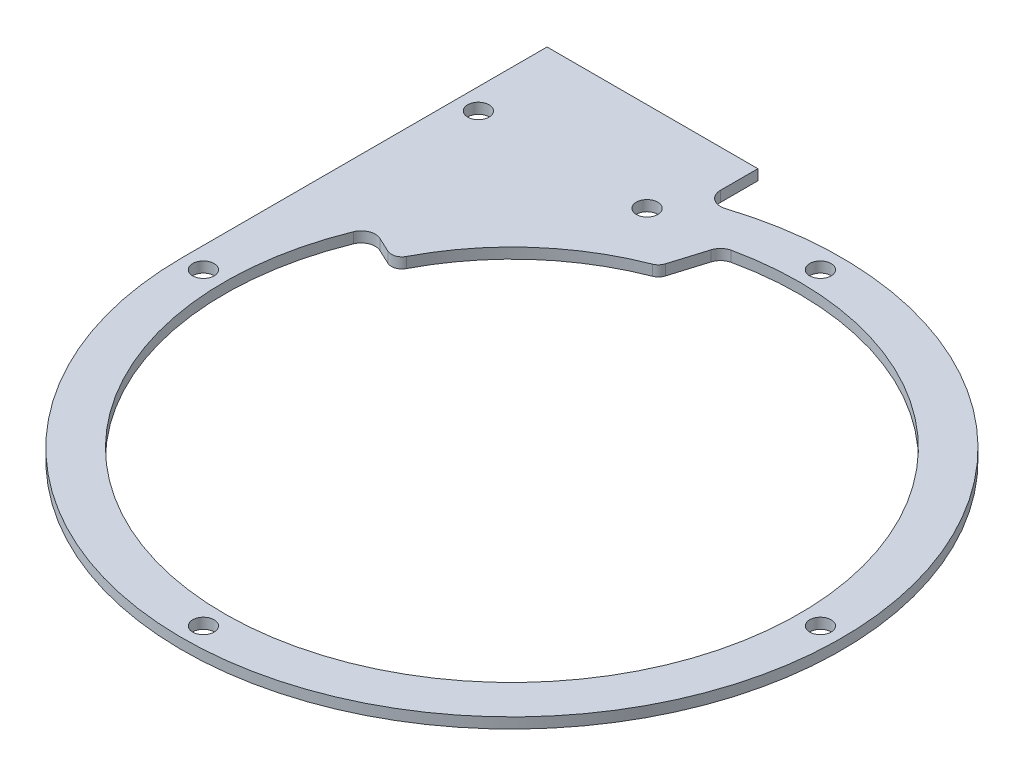
ISO-10303-21;
HEADER;
FILE_DESCRIPTION(('STEP AP214'),'2;1');
FILE_NAME('part.step','',(''),(''),'','','');
FILE_SCHEMA(('AUTOMOTIVE_DESIGN { 1 0 10303 214 1 1 1 1 }'));
ENDSEC;
DATA;
#1=APPLICATION_CONTEXT('core data for automotive mechanical design processes');
#2=APPLICATION_PROTOCOL_DEFINITION('international standard','automotive_design',2000,#1);
#3=PRODUCT_CONTEXT('',#1,'mechanical');
#4=PRODUCT('Part','Part','',(#3));
#5=PRODUCT_RELATED_PRODUCT_CATEGORY('part','',(#4));
#6=PRODUCT_DEFINITION_FORMATION('','',#4);
#7=PRODUCT_DEFINITION_CONTEXT('part definition',#1,'design');
#8=PRODUCT_DEFINITION('design','',#6,#7);
#9=PRODUCT_DEFINITION_SHAPE('','',#8);
#10=(LENGTH_UNIT() NAMED_UNIT(*) SI_UNIT(.MILLI.,.METRE.));
#11=(NAMED_UNIT(*) PLANE_ANGLE_UNIT() SI_UNIT($,.RADIAN.));
#12=(NAMED_UNIT(*) SI_UNIT($,.STERADIAN.) SOLID_ANGLE_UNIT());
#13=UNCERTAINTY_MEASURE_WITH_UNIT(LENGTH_MEASURE(1.E-05),#10,'distance_accuracy_value','');
#14=(GEOMETRIC_REPRESENTATION_CONTEXT(3) GLOBAL_UNCERTAINTY_ASSIGNED_CONTEXT((#13)) GLOBAL_UNIT_ASSIGNED_CONTEXT((#10,
#11,#12)) REPRESENTATION_CONTEXT('',''));
#15=CARTESIAN_POINT('',(0.,0.,0.));
#16=DIRECTION('',(0.,0.,1.));
#17=DIRECTION('',(1.,0.,0.));
#18=AXIS2_PLACEMENT_3D('',#15,#16,#17);
#19=CARTESIAN_POINT('',(0.,1.5,0.));
#20=DIRECTION('',(0.,-1.,0.));
#21=DIRECTION('',(0.,0.,-1.));
#22=AXIS2_PLACEMENT_3D('',#19,#20,#21);
#23=CYLINDRICAL_SURFACE('',#22,40.9);
#24=CARTESIAN_POINT('',(0.,1.5,0.));
#25=DIRECTION('',(0.,1.,0.));
#26=DIRECTION('',(0.,0.,1.));
#27=AXIS2_PLACEMENT_3D('',#24,#25,#26);
#28=CIRCLE('',#27,40.9);
#29=CARTESIAN_POINT('',(-37.9076569607055,1.5,-15.3564170218667));
#30=VERTEX_POINT('',#29);
#31=CARTESIAN_POINT('',(-8.74573285305339,1.5,-39.9540005113759));
#32=VERTEX_POINT('',#31);
#33=EDGE_CURVE('E233',#30,#32,#28,.T.);
#34=ORIENTED_EDGE('',*,*,#33,.T.);
#35=DIRECTION('',(0.,-1.,0.));
#36=VECTOR('',#35,1.);
#37=CARTESIAN_POINT('',(-8.74573285305339,1.5,-39.9540005113759));
#38=LINE('',#37,#36);
#39=CARTESIAN_POINT('',(-8.74573285305339,0.,-39.9540005113759));
#40=VERTEX_POINT('',#39);
#41=EDGE_CURVE('E261',#32,#40,#38,.T.);
#42=ORIENTED_EDGE('',*,*,#41,.T.);
#43=CARTESIAN_POINT('',(0.,0.,0.));
#44=DIRECTION('',(0.,1.,0.));
#45=DIRECTION('',(0.,0.,1.));
#46=AXIS2_PLACEMENT_3D('',#43,#44,#45);
#47=CIRCLE('',#46,40.9);
#48=CARTESIAN_POINT('',(-37.9076569607055,0.,-15.3564170218667));
#49=VERTEX_POINT('',#48);
#50=EDGE_CURVE('E230',#49,#40,#47,.T.);
#51=ORIENTED_EDGE('',*,*,#50,.F.);
#52=DIRECTION('',(0.,-1.,0.));
#53=VECTOR('',#52,1.);
#54=CARTESIAN_POINT('',(-37.9076569607055,1.5,-15.3564170218667));
#55=LINE('',#54,#53);
#56=EDGE_CURVE('E259',#49,#30,#55,.F.);
#57=ORIENTED_EDGE('',*,*,#56,.T.);
#58=EDGE_LOOP('',(#34,#42,#51,#57));
#59=FACE_BOUND('',#58,.T.);
#60=ADVANCED_FACE('F34',(#59),#23,.F.);
#61=CARTESIAN_POINT('',(0.,1.5,0.));
#62=DIRECTION('',(0.,1.,0.));
#63=DIRECTION('',(0.,0.,1.));
#64=AXIS2_PLACEMENT_3D('',#61,#62,#63);
#65=PLANE('',#64);
#66=CARTESIAN_POINT('',(-43.9,1.5,0.));
#67=DIRECTION('',(0.,1.,0.));
#68=DIRECTION('',(0.,0.,1.));
#69=AXIS2_PLACEMENT_3D('',#66,#67,#68);
#70=CIRCLE('',#69,1.525);
#71=CARTESIAN_POINT('',(-43.9,1.5,1.525));
#72=VERTEX_POINT('',#71);
#73=EDGE_CURVE('E203',#72,#72,#70,.T.);
#74=ORIENTED_EDGE('',*,*,#73,.F.);
#75=EDGE_LOOP('',(#74));
#76=FACE_BOUND('',#75,.T.);
#77=CARTESIAN_POINT('',(43.9,1.5,0.));
#78=DIRECTION('',(0.,1.,0.));
#79=DIRECTION('',(0.,0.,1.));
#80=AXIS2_PLACEMENT_3D('',#77,#78,#79);
#81=CIRCLE('',#80,1.525);
#82=CARTESIAN_POINT('',(43.9,1.5,1.52500000000001));
#83=VERTEX_POINT('',#82);
#84=EDGE_CURVE('E215',#83,#83,#81,.T.);
#85=ORIENTED_EDGE('',*,*,#84,.F.);
#86=EDGE_LOOP('',(#85));
#87=FACE_BOUND('',#86,.T.);
#88=CARTESIAN_POINT('',(-19.9,1.5,-39.1305507244659));
#89=DIRECTION('',(0.,1.,0.));
#90=DIRECTION('',(0.,0.,1.));
#91=AXIS2_PLACEMENT_3D('',#88,#89,#90);
#92=CIRCLE('',#91,1.525);
#93=CARTESIAN_POINT('',(-19.9,1.5,-37.6055507244659));
#94=VERTEX_POINT('',#93);
#95=EDGE_CURVE('E227',#94,#94,#92,.T.);
#96=ORIENTED_EDGE('',*,*,#95,.F.);
#97=EDGE_LOOP('',(#96));
#98=FACE_BOUND('',#97,.T.);
#99=CARTESIAN_POINT('',(0.,1.5,0.));
#100=DIRECTION('',(0.,1.,0.));
#101=DIRECTION('',(0.,0.,1.));
#102=AXIS2_PLACEMENT_3D('',#99,#100,#101);
#103=CIRCLE('',#102,46.9);
#104=CARTESIAN_POINT('',(-46.9,1.5,0.));
#105=VERTEX_POINT('',#104);
#106=CARTESIAN_POINT('',(-14.2905930470348,1.5,-44.6697766992856));
#107=VERTEX_POINT('',#106);
#108=EDGE_CURVE('E239',#105,#107,#103,.T.);
#109=ORIENTED_EDGE('',*,*,#108,.T.);
#110=CARTESIAN_POINT('',(-14.9,1.5,-46.5746712280398));
#111=DIRECTION('',(0.,-1.,0.));
#112=DIRECTION('',(0.,0.,1.));
#113=AXIS2_PLACEMENT_3D('',#110,#111,#112);
#114=CIRCLE('',#113,2.00000000000001);
#115=CARTESIAN_POINT('',(-16.9,1.5,-46.5746712280398));
#116=VERTEX_POINT('',#115);
#117=EDGE_CURVE('E242',#107,#116,#114,.T.);
#118=ORIENTED_EDGE('',*,*,#117,.T.);
#119=DIRECTION('',(0.,0.,-1.));
#120=VECTOR('',#119,1.);
#121=CARTESIAN_POINT('',(-16.9,1.5,-46.9));
#122=LINE('',#121,#120);
#123=CARTESIAN_POINT('',(-16.9,1.5,-51.9));
#124=VERTEX_POINT('',#123);
#125=EDGE_CURVE('E244',#116,#124,#122,.T.);
#126=ORIENTED_EDGE('',*,*,#125,.T.);
#127=DIRECTION('',(-1.,0.,0.));
#128=VECTOR('',#127,1.);
#129=CARTESIAN_POINT('',(-46.9,1.5,-51.9));
#130=LINE('',#129,#128);
#131=CARTESIAN_POINT('',(-46.9,1.5,-51.9));
#132=VERTEX_POINT('',#131);
#133=EDGE_CURVE('E148',#124,#132,#130,.T.);
#134=ORIENTED_EDGE('',*,*,#133,.T.);
#135=DIRECTION('',(0.,0.,1.));
#136=VECTOR('',#135,1.);
#137=CARTESIAN_POINT('',(-46.9,1.5,0.));
#138=LINE('',#137,#136);
#139=EDGE_CURVE('E246',#132,#105,#138,.T.);
#140=ORIENTED_EDGE('',*,*,#139,.T.);
#141=EDGE_LOOP('',(#109,#118,#126,#134,#140));
#142=FACE_BOUND('',#141,.T.);
#143=ORIENTED_EDGE('',*,*,#33,.F.);
#144=CARTESIAN_POINT('',(-36.0539818037028,1.5,-14.6054919841226));
#145=DIRECTION('',(0.,1.,0.));
#146=DIRECTION('',(0.,0.,1.));
#147=AXIS2_PLACEMENT_3D('',#144,#145,#146);
#148=CIRCLE('',#147,2.);
#149=CARTESIAN_POINT('',(-35.2087452802214,1.5,-16.4181075581959));
#150=VERTEX_POINT('',#149);
#151=EDGE_CURVE('E11',#30,#150,#148,.F.);
#152=ORIENTED_EDGE('',*,*,#151,.T.);
#153=DIRECTION('',(0.906307787036649,0.,0.422618261740701));
#154=VECTOR('',#153,1.);
#155=CARTESIAN_POINT('',(-37.067988489799,1.5,-17.2850869051946));
#156=LINE('',#155,#154);
#157=CARTESIAN_POINT('',(-33.0522882784468,1.5,-15.4125351437864));
#158=VERTEX_POINT('',#157);
#159=EDGE_CURVE('E182',#150,#158,#156,.T.);
#160=ORIENTED_EDGE('',*,*,#159,.T.);
#161=CARTESIAN_POINT('',(-32.4183608858357,1.5,-16.7719968243414));
#162=DIRECTION('',(0.,1.,0.));
#163=DIRECTION('',(0.,0.,1.));
#164=AXIS2_PLACEMENT_3D('',#161,#162,#163);
#165=CIRCLE('',#164,1.50000000000001);
#166=CARTESIAN_POINT('',(-31.0860994795685,1.5,-16.0827366808753));
#167=VERTEX_POINT('',#166);
#168=EDGE_CURVE('E178',#158,#167,#165,.T.);
#169=ORIENTED_EDGE('',*,*,#168,.T.);
#170=CARTESIAN_POINT('',(0.,1.5,0.));
#171=DIRECTION('',(0.,1.,0.));
#172=DIRECTION('',(0.,0.,1.));
#173=AXIS2_PLACEMENT_3D('',#170,#171,#172);
#174=CIRCLE('',#173,35.);
#175=CARTESIAN_POINT('',(-12.6475074807613,1.5,-32.6349590856812));
#176=VERTEX_POINT('',#175);
#177=EDGE_CURVE('E163',#167,#176,#174,.F.);
#178=ORIENTED_EDGE('',*,*,#177,.T.);
#179=CARTESIAN_POINT('',(-13.1895435156511,1.5,-34.0336001893533));
#180=DIRECTION('',(0.,1.,0.));
#181=DIRECTION('',(0.,0.,1.));
#182=AXIS2_PLACEMENT_3D('',#179,#180,#181);
#183=CIRCLE('',#182,1.5);
#184=CARTESIAN_POINT('',(-11.7549918977161,1.5,-33.5953517946271));
#185=VERTEX_POINT('',#184);
#186=EDGE_CURVE('E187',#176,#185,#183,.T.);
#187=ORIENTED_EDGE('',*,*,#186,.T.);
#188=DIRECTION('',(0.292165596484111,0.,-0.956367745290003));
#189=VECTOR('',#188,1.);
#190=CARTESIAN_POINT('',(-11.7549918977161,1.5,-33.5953517946271));
#191=LINE('',#190,#189);
#192=CARTESIAN_POINT('',(-10.2308041454401,1.5,-38.5845908480421));
#193=VERTEX_POINT('',#192);
#194=EDGE_CURVE('E184',#185,#193,#191,.T.);
#195=ORIENTED_EDGE('',*,*,#194,.T.);
#196=CARTESIAN_POINT('',(-8.31806865486007,1.5,-38.0002596550739));
#197=DIRECTION('',(0.,1.,0.));
#198=DIRECTION('',(0.,0.,1.));
#199=AXIS2_PLACEMENT_3D('',#196,#197,#198);
#200=CIRCLE('',#199,2.);
#201=EDGE_CURVE('E270',#193,#32,#200,.F.);
#202=ORIENTED_EDGE('',*,*,#201,.T.);
#203=EDGE_LOOP('',(#143,#152,#160,#169,#178,#187,#195,#202));
#204=FACE_BOUND('',#203,.T.);
#205=CARTESIAN_POINT('',(0.,1.5,-43.9));
#206=DIRECTION('',(0.,1.,0.));
#207=DIRECTION('',(0.,0.,1.));
#208=AXIS2_PLACEMENT_3D('',#205,#206,#207);
#209=CIRCLE('',#208,1.525);
#210=CARTESIAN_POINT('',(0.,1.5,-42.375));
#211=VERTEX_POINT('',#210);
#212=EDGE_CURVE('E221',#211,#211,#209,.T.);
#213=ORIENTED_EDGE('',*,*,#212,.F.);
#214=EDGE_LOOP('',(#213));
#215=FACE_BOUND('',#214,.T.);
#216=CARTESIAN_POINT('',(0.,1.5,43.9));
#217=DIRECTION('',(0.,1.,0.));
#218=DIRECTION('',(0.,0.,1.));
#219=AXIS2_PLACEMENT_3D('',#216,#217,#218);
#220=CIRCLE('',#219,1.525);
#221=CARTESIAN_POINT('',(0.,1.5,45.425));
#222=VERTEX_POINT('',#221);
#223=EDGE_CURVE('E209',#222,#222,#220,.T.);
#224=ORIENTED_EDGE('',*,*,#223,.F.);
#225=EDGE_LOOP('',(#224));
#226=FACE_BOUND('',#225,.T.);
#227=CARTESIAN_POINT('',(-43.9,1.5,-39.1305507244659));
#228=DIRECTION('',(0.,1.,0.));
#229=DIRECTION('',(0.,0.,1.));
#230=AXIS2_PLACEMENT_3D('',#227,#228,#229);
#231=CIRCLE('',#230,1.525);
#232=CARTESIAN_POINT('',(-43.9,1.5,-37.6055507244659));
#233=VERTEX_POINT('',#232);
#234=EDGE_CURVE('E197',#233,#233,#231,.T.);
#235=ORIENTED_EDGE('',*,*,#234,.F.);
#236=EDGE_LOOP('',(#235));
#237=FACE_BOUND('',#236,.T.);
#238=ADVANCED_FACE('F281',(#76,#87,#98,#142,#204,#215,#226,#237),#65,.T.);
#239=CARTESIAN_POINT('',(0.,0.,0.));
#240=DIRECTION('',(0.,1.,0.));
#241=DIRECTION('',(0.,0.,1.));
#242=AXIS2_PLACEMENT_3D('',#239,#240,#241);
#243=PLANE('',#242);
#244=CARTESIAN_POINT('',(0.,0.,0.));
#245=DIRECTION('',(0.,1.,0.));
#246=DIRECTION('',(0.,0.,1.));
#247=AXIS2_PLACEMENT_3D('',#244,#245,#246);
#248=CIRCLE('',#247,46.9);
#249=CARTESIAN_POINT('',(-46.9,0.,0.));
#250=VERTEX_POINT('',#249);
#251=CARTESIAN_POINT('',(-14.2905930470348,0.,-44.6697766992856));
#252=VERTEX_POINT('',#251);
#253=EDGE_CURVE('E236',#250,#252,#248,.T.);
#254=ORIENTED_EDGE('',*,*,#253,.F.);
#255=DIRECTION('',(0.,0.,1.));
#256=VECTOR('',#255,1.);
#257=CARTESIAN_POINT('',(-46.9,0.,0.));
#258=LINE('',#257,#256);
#259=CARTESIAN_POINT('',(-46.9,0.,-51.9));
#260=VERTEX_POINT('',#259);
#261=EDGE_CURVE('E139',#260,#250,#258,.T.);
#262=ORIENTED_EDGE('',*,*,#261,.F.);
#263=DIRECTION('',(-1.,0.,0.));
#264=VECTOR('',#263,1.);
#265=CARTESIAN_POINT('',(-46.9,0.,-51.9));
#266=LINE('',#265,#264);
#267=CARTESIAN_POINT('',(-16.9,0.,-51.9));
#268=VERTEX_POINT('',#267);
#269=EDGE_CURVE('E146',#268,#260,#266,.T.);
#270=ORIENTED_EDGE('',*,*,#269,.F.);
#271=DIRECTION('',(0.,0.,-1.));
#272=VECTOR('',#271,1.);
#273=CARTESIAN_POINT('',(-16.9,0.,-46.9));
#274=LINE('',#273,#272);
#275=CARTESIAN_POINT('',(-16.9,0.,-46.5746712280398));
#276=VERTEX_POINT('',#275);
#277=EDGE_CURVE('E129',#276,#268,#274,.T.);
#278=ORIENTED_EDGE('',*,*,#277,.F.);
#279=CARTESIAN_POINT('',(-14.9,0.,-46.5746712280398));
#280=DIRECTION('',(0.,-1.,0.));
#281=DIRECTION('',(0.,0.,1.));
#282=AXIS2_PLACEMENT_3D('',#279,#280,#281);
#283=CIRCLE('',#282,2.00000000000001);
#284=EDGE_CURVE('E140',#252,#276,#283,.T.);
#285=ORIENTED_EDGE('',*,*,#284,.F.);
#286=EDGE_LOOP('',(#254,#262,#270,#278,#285));
#287=FACE_BOUND('',#286,.T.);
#288=DIRECTION('',(0.906307787036649,0.,0.422618261740701));
#289=VECTOR('',#288,1.);
#290=CARTESIAN_POINT('',(-37.067988489799,0.,-17.2850869051946));
#291=LINE('',#290,#289);
#292=CARTESIAN_POINT('',(-35.2087452802214,0.,-16.4181075581959));
#293=VERTEX_POINT('',#292);
#294=CARTESIAN_POINT('',(-33.0522882784468,0.,-15.4125351437864));
#295=VERTEX_POINT('',#294);
#296=EDGE_CURVE('E169',#293,#295,#291,.T.);
#297=ORIENTED_EDGE('',*,*,#296,.F.);
#298=CARTESIAN_POINT('',(-36.0539818037028,0.,-14.6054919841226));
#299=DIRECTION('',(0.,1.,0.));
#300=DIRECTION('',(0.,0.,1.));
#301=AXIS2_PLACEMENT_3D('',#298,#299,#300);
#302=CIRCLE('',#301,2.);
#303=EDGE_CURVE('E42',#293,#49,#302,.T.);
#304=ORIENTED_EDGE('',*,*,#303,.T.);
#305=ORIENTED_EDGE('',*,*,#50,.T.);
#306=CARTESIAN_POINT('',(-8.31806865486007,0.,-38.0002596550739));
#307=DIRECTION('',(0.,1.,0.));
#308=DIRECTION('',(0.,0.,1.));
#309=AXIS2_PLACEMENT_3D('',#306,#307,#308);
#310=CIRCLE('',#309,2.);
#311=CARTESIAN_POINT('',(-10.2308041454401,0.,-38.5845908480421));
#312=VERTEX_POINT('',#311);
#313=EDGE_CURVE('E268',#40,#312,#310,.T.);
#314=ORIENTED_EDGE('',*,*,#313,.T.);
#315=DIRECTION('',(0.292165596484111,0.,-0.956367745290003));
#316=VECTOR('',#315,1.);
#317=CARTESIAN_POINT('',(-11.7549918977161,0.,-33.5953517946271));
#318=LINE('',#317,#316);
#319=CARTESIAN_POINT('',(-11.7549918977161,0.,-33.5953517946271));
#320=VERTEX_POINT('',#319);
#321=EDGE_CURVE('E171',#320,#312,#318,.T.);
#322=ORIENTED_EDGE('',*,*,#321,.F.);
#323=CARTESIAN_POINT('',(-13.1895435156511,0.,-34.0336001893533));
#324=DIRECTION('',(0.,1.,0.));
#325=DIRECTION('',(0.,0.,1.));
#326=AXIS2_PLACEMENT_3D('',#323,#324,#325);
#327=CIRCLE('',#326,1.5);
#328=CARTESIAN_POINT('',(-12.6475074807613,0.,-32.6349590856812));
#329=VERTEX_POINT('',#328);
#330=EDGE_CURVE('E175',#329,#320,#327,.T.);
#331=ORIENTED_EDGE('',*,*,#330,.F.);
#332=CARTESIAN_POINT('',(0.,0.,0.));
#333=DIRECTION('',(0.,-1.,0.));
#334=DIRECTION('',(0.,0.,1.));
#335=AXIS2_PLACEMENT_3D('',#332,#333,#334);
#336=CIRCLE('',#335,35.);
#337=CARTESIAN_POINT('',(-31.0860994795685,0.,-16.0827366808753));
#338=VERTEX_POINT('',#337);
#339=EDGE_CURVE('E160',#338,#329,#336,.T.);
#340=ORIENTED_EDGE('',*,*,#339,.F.);
#341=CARTESIAN_POINT('',(-32.4183608858357,0.,-16.7719968243414));
#342=DIRECTION('',(0.,1.,0.));
#343=DIRECTION('',(0.,0.,1.));
#344=AXIS2_PLACEMENT_3D('',#341,#342,#343);
#345=CIRCLE('',#344,1.50000000000001);
#346=EDGE_CURVE('E165',#295,#338,#345,.T.);
#347=ORIENTED_EDGE('',*,*,#346,.F.);
#348=EDGE_LOOP('',(#297,#304,#305,#314,#322,#331,#340,#347));
#349=FACE_BOUND('',#348,.T.);
#350=CARTESIAN_POINT('',(-19.9,0.,-39.1305507244659));
#351=DIRECTION('',(0.,1.,0.));
#352=DIRECTION('',(0.,0.,1.));
#353=AXIS2_PLACEMENT_3D('',#350,#351,#352);
#354=CIRCLE('',#353,1.525);
#355=CARTESIAN_POINT('',(-19.9,0.,-37.6055507244659));
#356=VERTEX_POINT('',#355);
#357=EDGE_CURVE('E224',#356,#356,#354,.T.);
#358=ORIENTED_EDGE('',*,*,#357,.T.);
#359=EDGE_LOOP('',(#358));
#360=FACE_BOUND('',#359,.T.);
#361=CARTESIAN_POINT('',(0.,0.,-43.9));
#362=DIRECTION('',(0.,1.,0.));
#363=DIRECTION('',(0.,0.,1.));
#364=AXIS2_PLACEMENT_3D('',#361,#362,#363);
#365=CIRCLE('',#364,1.525);
#366=CARTESIAN_POINT('',(0.,0.,-42.375));
#367=VERTEX_POINT('',#366);
#368=EDGE_CURVE('E218',#367,#367,#365,.T.);
#369=ORIENTED_EDGE('',*,*,#368,.T.);
#370=EDGE_LOOP('',(#369));
#371=FACE_BOUND('',#370,.T.);
#372=CARTESIAN_POINT('',(43.9,0.,0.));
#373=DIRECTION('',(0.,1.,0.));
#374=DIRECTION('',(0.,0.,1.));
#375=AXIS2_PLACEMENT_3D('',#372,#373,#374);
#376=CIRCLE('',#375,1.525);
#377=CARTESIAN_POINT('',(43.9,0.,1.52500000000001));
#378=VERTEX_POINT('',#377);
#379=EDGE_CURVE('E212',#378,#378,#376,.T.);
#380=ORIENTED_EDGE('',*,*,#379,.T.);
#381=EDGE_LOOP('',(#380));
#382=FACE_BOUND('',#381,.T.);
#383=CARTESIAN_POINT('',(0.,0.,43.9));
#384=DIRECTION('',(0.,1.,0.));
#385=DIRECTION('',(0.,0.,1.));
#386=AXIS2_PLACEMENT_3D('',#383,#384,#385);
#387=CIRCLE('',#386,1.525);
#388=CARTESIAN_POINT('',(0.,0.,45.425));
#389=VERTEX_POINT('',#388);
#390=EDGE_CURVE('E206',#389,#389,#387,.T.);
#391=ORIENTED_EDGE('',*,*,#390,.T.);
#392=EDGE_LOOP('',(#391));
#393=FACE_BOUND('',#392,.T.);
#394=CARTESIAN_POINT('',(-43.9,0.,0.));
#395=DIRECTION('',(0.,1.,0.));
#396=DIRECTION('',(0.,0.,1.));
#397=AXIS2_PLACEMENT_3D('',#394,#395,#396);
#398=CIRCLE('',#397,1.525);
#399=CARTESIAN_POINT('',(-43.9,0.,1.525));
#400=VERTEX_POINT('',#399);
#401=EDGE_CURVE('E200',#400,#400,#398,.T.);
#402=ORIENTED_EDGE('',*,*,#401,.T.);
#403=EDGE_LOOP('',(#402));
#404=FACE_BOUND('',#403,.T.);
#405=CARTESIAN_POINT('',(-43.9,0.,-39.1305507244659));
#406=DIRECTION('',(0.,1.,0.));
#407=DIRECTION('',(0.,0.,1.));
#408=AXIS2_PLACEMENT_3D('',#405,#406,#407);
#409=CIRCLE('',#408,1.525);
#410=CARTESIAN_POINT('',(-43.9,0.,-37.6055507244659));
#411=VERTEX_POINT('',#410);
#412=EDGE_CURVE('E181',#411,#411,#409,.T.);
#413=ORIENTED_EDGE('',*,*,#412,.T.);
#414=EDGE_LOOP('',(#413));
#415=FACE_BOUND('',#414,.T.);
#416=ADVANCED_FACE('F152',(#287,#349,#360,#371,#382,#393,#404,#415),#243,.F.);
#417=CARTESIAN_POINT('',(0.,1.5,0.));
#418=DIRECTION('',(0.,-1.,0.));
#419=DIRECTION('',(0.,0.,-1.));
#420=AXIS2_PLACEMENT_3D('',#417,#418,#419);
#421=CYLINDRICAL_SURFACE('',#420,46.9);
#422=ORIENTED_EDGE('',*,*,#253,.T.);
#423=DIRECTION('',(0.,-1.,0.));
#424=VECTOR('',#423,1.);
#425=CARTESIAN_POINT('',(-14.2905930470348,1.5,-44.6697766992856));
#426=LINE('',#425,#424);
#427=EDGE_CURVE('E256',#107,#252,#426,.T.);
#428=ORIENTED_EDGE('',*,*,#427,.F.);
#429=ORIENTED_EDGE('',*,*,#108,.F.);
#430=DIRECTION('',(0.,-1.,0.));
#431=VECTOR('',#430,1.);
#432=CARTESIAN_POINT('',(-46.9,1.5,0.));
#433=LINE('',#432,#431);
#434=EDGE_CURVE('E248',#105,#250,#433,.T.);
#435=ORIENTED_EDGE('',*,*,#434,.T.);
#436=EDGE_LOOP('',(#422,#428,#429,#435));
#437=FACE_BOUND('',#436,.T.);
#438=ADVANCED_FACE('F321',(#437),#421,.T.);
#439=CARTESIAN_POINT('',(-14.9,1.5,-46.5746712280398));
#440=DIRECTION('',(0.,-1.,0.));
#441=DIRECTION('',(0.,0.,-1.));
#442=AXIS2_PLACEMENT_3D('',#439,#440,#441);
#443=CYLINDRICAL_SURFACE('',#442,2.00000000000001);
#444=ORIENTED_EDGE('',*,*,#284,.T.);
#445=DIRECTION('',(0.,-1.,0.));
#446=VECTOR('',#445,1.);
#447=CARTESIAN_POINT('',(-16.9,1.5,-46.5746712280398));
#448=LINE('',#447,#446);
#449=EDGE_CURVE('E136',#116,#276,#448,.T.);
#450=ORIENTED_EDGE('',*,*,#449,.F.);
#451=ORIENTED_EDGE('',*,*,#117,.F.);
#452=ORIENTED_EDGE('',*,*,#427,.T.);
#453=EDGE_LOOP('',(#444,#450,#451,#452));
#454=FACE_BOUND('',#453,.T.);
#455=ADVANCED_FACE('F328',(#454),#443,.F.);
#456=CARTESIAN_POINT('',(-16.9,1.5,-46.9));
#457=DIRECTION('',(-1.,0.,0.));
#458=DIRECTION('',(0.,0.,1.));
#459=AXIS2_PLACEMENT_3D('',#456,#457,#458);
#460=PLANE('',#459);
#461=ORIENTED_EDGE('',*,*,#277,.T.);
#462=DIRECTION('',(0.,1.,0.));
#463=VECTOR('',#462,1.);
#464=CARTESIAN_POINT('',(-16.9,0.,-51.9));
#465=LINE('',#464,#463);
#466=EDGE_CURVE('E133',#268,#124,#465,.T.);
#467=ORIENTED_EDGE('',*,*,#466,.T.);
#468=ORIENTED_EDGE('',*,*,#125,.F.);
#469=ORIENTED_EDGE('',*,*,#449,.T.);
#470=EDGE_LOOP('',(#461,#467,#468,#469));
#471=FACE_BOUND('',#470,.T.);
#472=ADVANCED_FACE('F131',(#471),#460,.F.);
#473=CARTESIAN_POINT('',(-46.9,1.5,0.));
#474=DIRECTION('',(1.,0.,0.));
#475=DIRECTION('',(0.,0.,-1.));
#476=AXIS2_PLACEMENT_3D('',#473,#474,#475);
#477=PLANE('',#476);
#478=ORIENTED_EDGE('',*,*,#261,.T.);
#479=ORIENTED_EDGE('',*,*,#434,.F.);
#480=ORIENTED_EDGE('',*,*,#139,.F.);
#481=DIRECTION('',(0.,1.,0.));
#482=VECTOR('',#481,1.);
#483=CARTESIAN_POINT('',(-46.9,0.,-51.9));
#484=LINE('',#483,#482);
#485=EDGE_CURVE('E149',#260,#132,#484,.T.);
#486=ORIENTED_EDGE('',*,*,#485,.F.);
#487=EDGE_LOOP('',(#478,#479,#480,#486));
#488=FACE_BOUND('',#487,.T.);
#489=ADVANCED_FACE('F322',(#488),#477,.F.);
#490=CARTESIAN_POINT('',(-19.9,1.5,-39.1305507244659));
#491=DIRECTION('',(0.,-1.,0.));
#492=DIRECTION('',(0.,0.,-1.));
#493=AXIS2_PLACEMENT_3D('',#490,#491,#492);
#494=CYLINDRICAL_SURFACE('',#493,1.525);
#495=ORIENTED_EDGE('',*,*,#95,.T.);
#496=EDGE_LOOP('',(#495));
#497=FACE_BOUND('',#496,.T.);
#498=ORIENTED_EDGE('',*,*,#357,.F.);
#499=EDGE_LOOP('',(#498));
#500=FACE_BOUND('',#499,.T.);
#501=ADVANCED_FACE('F316',(#497,#500),#494,.F.);
#502=CARTESIAN_POINT('',(0.,1.5,-43.9));
#503=DIRECTION('',(0.,-1.,0.));
#504=DIRECTION('',(0.,0.,-1.));
#505=AXIS2_PLACEMENT_3D('',#502,#503,#504);
#506=CYLINDRICAL_SURFACE('',#505,1.525);
#507=ORIENTED_EDGE('',*,*,#212,.T.);
#508=EDGE_LOOP('',(#507));
#509=FACE_BOUND('',#508,.T.);
#510=ORIENTED_EDGE('',*,*,#368,.F.);
#511=EDGE_LOOP('',(#510));
#512=FACE_BOUND('',#511,.T.);
#513=ADVANCED_FACE('F360',(#509,#512),#506,.F.);
#514=CARTESIAN_POINT('',(43.9,1.5,0.));
#515=DIRECTION('',(0.,-1.,0.));
#516=DIRECTION('',(0.,0.,-1.));
#517=AXIS2_PLACEMENT_3D('',#514,#515,#516);
#518=CYLINDRICAL_SURFACE('',#517,1.525);
#519=ORIENTED_EDGE('',*,*,#84,.T.);
#520=EDGE_LOOP('',(#519));
#521=FACE_BOUND('',#520,.T.);
#522=ORIENTED_EDGE('',*,*,#379,.F.);
#523=EDGE_LOOP('',(#522));
#524=FACE_BOUND('',#523,.T.);
#525=ADVANCED_FACE('F367',(#521,#524),#518,.F.);
#526=CARTESIAN_POINT('',(0.,1.5,43.9));
#527=DIRECTION('',(0.,-1.,0.));
#528=DIRECTION('',(0.,0.,-1.));
#529=AXIS2_PLACEMENT_3D('',#526,#527,#528);
#530=CYLINDRICAL_SURFACE('',#529,1.525);
#531=ORIENTED_EDGE('',*,*,#223,.T.);
#532=EDGE_LOOP('',(#531));
#533=FACE_BOUND('',#532,.T.);
#534=ORIENTED_EDGE('',*,*,#390,.F.);
#535=EDGE_LOOP('',(#534));
#536=FACE_BOUND('',#535,.T.);
#537=ADVANCED_FACE('F374',(#533,#536),#530,.F.);
#538=CARTESIAN_POINT('',(-43.9,1.5,0.));
#539=DIRECTION('',(0.,-1.,0.));
#540=DIRECTION('',(0.,0.,-1.));
#541=AXIS2_PLACEMENT_3D('',#538,#539,#540);
#542=CYLINDRICAL_SURFACE('',#541,1.525);
#543=ORIENTED_EDGE('',*,*,#73,.T.);
#544=EDGE_LOOP('',(#543));
#545=FACE_BOUND('',#544,.T.);
#546=ORIENTED_EDGE('',*,*,#401,.F.);
#547=EDGE_LOOP('',(#546));
#548=FACE_BOUND('',#547,.T.);
#549=ADVANCED_FACE('F382',(#545,#548),#542,.F.);
#550=CARTESIAN_POINT('',(-43.9,1.5,-39.1305507244659));
#551=DIRECTION('',(0.,-1.,0.));
#552=DIRECTION('',(0.,0.,-1.));
#553=AXIS2_PLACEMENT_3D('',#550,#551,#552);
#554=CYLINDRICAL_SURFACE('',#553,1.525);
#555=ORIENTED_EDGE('',*,*,#234,.T.);
#556=EDGE_LOOP('',(#555));
#557=FACE_BOUND('',#556,.T.);
#558=ORIENTED_EDGE('',*,*,#412,.F.);
#559=EDGE_LOOP('',(#558));
#560=FACE_BOUND('',#559,.T.);
#561=ADVANCED_FACE('F390',(#557,#560),#554,.F.);
#562=CARTESIAN_POINT('',(-13.1895435156511,38.0293322414599,-34.0336001893533));
#563=DIRECTION('',(0.,-1.,0.));
#564=DIRECTION('',(0.,0.,-1.));
#565=AXIS2_PLACEMENT_3D('',#562,#563,#564);
#566=CYLINDRICAL_SURFACE('',#565,1.5);
#567=ORIENTED_EDGE('',*,*,#186,.F.);
#568=DIRECTION('',(0.,-1.,0.));
#569=VECTOR('',#568,1.);
#570=CARTESIAN_POINT('',(-12.6475074807613,38.0293322414599,-32.6349590856812));
#571=LINE('',#570,#569);
#572=EDGE_CURVE('E158',#176,#329,#571,.T.);
#573=ORIENTED_EDGE('',*,*,#572,.T.);
#574=ORIENTED_EDGE('',*,*,#330,.T.);
#575=DIRECTION('',(0.,-1.,0.));
#576=VECTOR('',#575,1.);
#577=CARTESIAN_POINT('',(-11.7549918977161,38.0293322414599,-33.5953517946271));
#578=LINE('',#577,#576);
#579=EDGE_CURVE('E174',#185,#320,#578,.T.);
#580=ORIENTED_EDGE('',*,*,#579,.F.);
#581=EDGE_LOOP('',(#567,#573,#574,#580));
#582=FACE_BOUND('',#581,.T.);
#583=ADVANCED_FACE('F293',(#582),#566,.T.);
#584=CARTESIAN_POINT('',(-11.7549918977161,38.0293322414599,-33.5953517946271));
#585=DIRECTION('',(-0.956367745290003,0.,-0.292165596484111));
#586=DIRECTION('',(-0.292165596484111,0.,0.956367745290003));
#587=AXIS2_PLACEMENT_3D('',#584,#585,#586);
#588=PLANE('',#587);
#589=ORIENTED_EDGE('',*,*,#321,.T.);
#590=DIRECTION('',(0.,-1.,0.));
#591=VECTOR('',#590,1.);
#592=CARTESIAN_POINT('',(-10.2308041454401,38.0293322414599,-38.5845908480421));
#593=LINE('',#592,#591);
#594=EDGE_CURVE('E264',#312,#193,#593,.F.);
#595=ORIENTED_EDGE('',*,*,#594,.T.);
#596=ORIENTED_EDGE('',*,*,#194,.F.);
#597=ORIENTED_EDGE('',*,*,#579,.T.);
#598=EDGE_LOOP('',(#589,#595,#596,#597));
#599=FACE_BOUND('',#598,.T.);
#600=ADVANCED_FACE('F297',(#599),#588,.F.);
#601=CARTESIAN_POINT('',(-37.067988489799,38.0293322414599,-17.2850869051946));
#602=DIRECTION('',(0.422618261740701,0.,-0.906307787036649));
#603=DIRECTION('',(-0.906307787036649,0.,-0.422618261740701));
#604=AXIS2_PLACEMENT_3D('',#601,#602,#603);
#605=PLANE('',#604);
#606=ORIENTED_EDGE('',*,*,#159,.F.);
#607=DIRECTION('',(0.,-1.,0.));
#608=VECTOR('',#607,1.);
#609=CARTESIAN_POINT('',(-35.2087452802214,38.0293322414599,-16.4181075581959));
#610=LINE('',#609,#608);
#611=EDGE_CURVE('E266',#150,#293,#610,.T.);
#612=ORIENTED_EDGE('',*,*,#611,.T.);
#613=ORIENTED_EDGE('',*,*,#296,.T.);
#614=DIRECTION('',(0.,-1.,0.));
#615=VECTOR('',#614,1.);
#616=CARTESIAN_POINT('',(-33.0522882784468,38.0293322414599,-15.4125351437864));
#617=LINE('',#616,#615);
#618=EDGE_CURVE('E168',#158,#295,#617,.T.);
#619=ORIENTED_EDGE('',*,*,#618,.F.);
#620=EDGE_LOOP('',(#606,#612,#613,#619));
#621=FACE_BOUND('',#620,.T.);
#622=ADVANCED_FACE('F278',(#621),#605,.F.);
#623=CARTESIAN_POINT('',(-32.4183608858357,38.0293322414599,-16.7719968243414));
#624=DIRECTION('',(0.,-1.,0.));
#625=DIRECTION('',(0.,0.,-1.));
#626=AXIS2_PLACEMENT_3D('',#623,#624,#625);
#627=CYLINDRICAL_SURFACE('',#626,1.50000000000001);
#628=ORIENTED_EDGE('',*,*,#168,.F.);
#629=ORIENTED_EDGE('',*,*,#618,.T.);
#630=ORIENTED_EDGE('',*,*,#346,.T.);
#631=DIRECTION('',(0.,-1.,0.));
#632=VECTOR('',#631,1.);
#633=CARTESIAN_POINT('',(-31.0860994795685,38.0293322414599,-16.0827366808753));
#634=LINE('',#633,#632);
#635=EDGE_CURVE('E164',#167,#338,#634,.T.);
#636=ORIENTED_EDGE('',*,*,#635,.F.);
#637=EDGE_LOOP('',(#628,#629,#630,#636));
#638=FACE_BOUND('',#637,.T.);
#639=ADVANCED_FACE('F284',(#638),#627,.T.);
#640=CARTESIAN_POINT('',(0.,38.0293322414599,0.));
#641=DIRECTION('',(0.,-1.,0.));
#642=DIRECTION('',(0.,0.,-1.));
#643=AXIS2_PLACEMENT_3D('',#640,#641,#642);
#644=CYLINDRICAL_SURFACE('',#643,35.);
#645=ORIENTED_EDGE('',*,*,#177,.F.);
#646=ORIENTED_EDGE('',*,*,#635,.T.);
#647=ORIENTED_EDGE('',*,*,#339,.T.);
#648=ORIENTED_EDGE('',*,*,#572,.F.);
#649=EDGE_LOOP('',(#645,#646,#647,#648));
#650=FACE_BOUND('',#649,.T.);
#651=ADVANCED_FACE('F288',(#650),#644,.F.);
#652=CARTESIAN_POINT('',(-8.31806865486007,1.5,-38.0002596550739));
#653=DIRECTION('',(0.,-1.,0.));
#654=DIRECTION('',(0.,0.,-1.));
#655=AXIS2_PLACEMENT_3D('',#652,#653,#654);
#656=CYLINDRICAL_SURFACE('',#655,2.);
#657=ORIENTED_EDGE('',*,*,#201,.F.);
#658=ORIENTED_EDGE('',*,*,#594,.F.);
#659=ORIENTED_EDGE('',*,*,#313,.F.);
#660=ORIENTED_EDGE('',*,*,#41,.F.);
#661=EDGE_LOOP('',(#657,#658,#659,#660));
#662=FACE_BOUND('',#661,.T.);
#663=ADVANCED_FACE('F300',(#662),#656,.F.);
#664=CARTESIAN_POINT('',(-36.0539818037028,1.5,-14.6054919841226));
#665=DIRECTION('',(0.,-1.,0.));
#666=DIRECTION('',(0.,0.,-1.));
#667=AXIS2_PLACEMENT_3D('',#664,#665,#666);
#668=CYLINDRICAL_SURFACE('',#667,2.);
#669=ORIENTED_EDGE('',*,*,#151,.F.);
#670=ORIENTED_EDGE('',*,*,#56,.F.);
#671=ORIENTED_EDGE('',*,*,#303,.F.);
#672=ORIENTED_EDGE('',*,*,#611,.F.);
#673=EDGE_LOOP('',(#669,#670,#671,#672));
#674=FACE_BOUND('',#673,.T.);
#675=ADVANCED_FACE('F36',(#674),#668,.F.);
#676=CARTESIAN_POINT('',(-46.9,0.,-51.9));
#677=DIRECTION('',(0.,0.,-1.));
#678=DIRECTION('',(-1.,0.,0.));
#679=AXIS2_PLACEMENT_3D('',#676,#677,#678);
#680=PLANE('',#679);
#681=ORIENTED_EDGE('',*,*,#133,.F.);
#682=ORIENTED_EDGE('',*,*,#466,.F.);
#683=ORIENTED_EDGE('',*,*,#269,.T.);
#684=ORIENTED_EDGE('',*,*,#485,.T.);
#685=EDGE_LOOP('',(#681,#682,#683,#684));
#686=FACE_BOUND('',#685,.T.);
#687=ADVANCED_FACE('F144',(#686),#680,.T.);
#688=CLOSED_SHELL('',(#60,#238,#416,#438,#455,#472,#489,#501,#513,#525,#537,#549,#561,#583,#600,
#622,#639,#651,#663,#675,#687));
#689=MANIFOLD_SOLID_BREP('B2',#688);
#690=ADVANCED_BREP_SHAPE_REPRESENTATION('',(#18,#689),#14);
#691=SHAPE_DEFINITION_REPRESENTATION(#9,#690);
ENDSEC;
END-ISO-10303-21;
